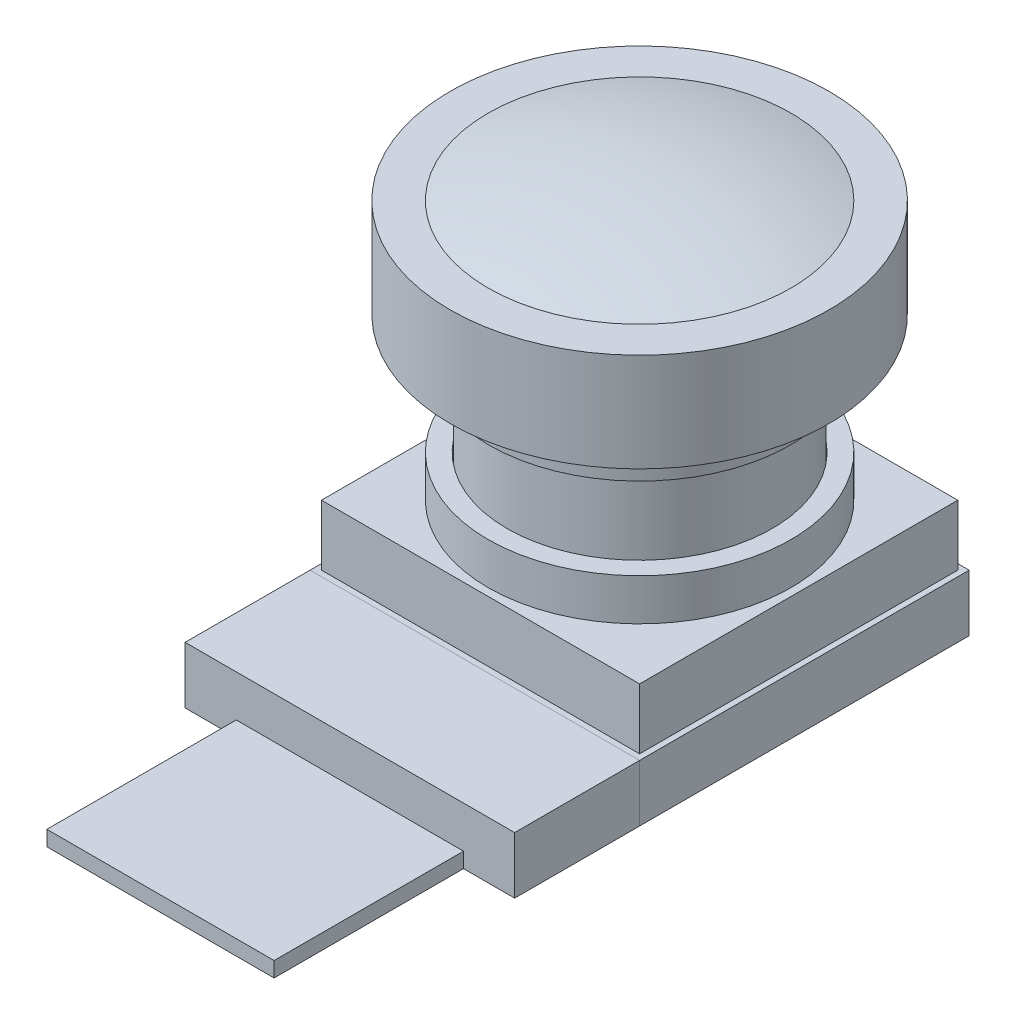
ISO-10303-21;
HEADER;
FILE_DESCRIPTION(('STEP AP214'),'2;1');
FILE_NAME('part.step','',(''),(''),'','','');
FILE_SCHEMA(('AUTOMOTIVE_DESIGN { 1 0 10303 214 1 1 1 1 }'));
ENDSEC;
DATA;
#1=APPLICATION_CONTEXT('core data for automotive mechanical design processes');
#2=APPLICATION_PROTOCOL_DEFINITION('international standard','automotive_design',2000,#1);
#3=PRODUCT_CONTEXT('',#1,'mechanical');
#4=PRODUCT('Part','Part','',(#3));
#5=PRODUCT_RELATED_PRODUCT_CATEGORY('part','',(#4));
#6=PRODUCT_DEFINITION_FORMATION('','',#4);
#7=PRODUCT_DEFINITION_CONTEXT('part definition',#1,'design');
#8=PRODUCT_DEFINITION('design','',#6,#7);
#9=PRODUCT_DEFINITION_SHAPE('','',#8);
#10=(LENGTH_UNIT() NAMED_UNIT(*) SI_UNIT(.MILLI.,.METRE.));
#11=(NAMED_UNIT(*) PLANE_ANGLE_UNIT() SI_UNIT($,.RADIAN.));
#12=(NAMED_UNIT(*) SI_UNIT($,.STERADIAN.) SOLID_ANGLE_UNIT());
#13=UNCERTAINTY_MEASURE_WITH_UNIT(LENGTH_MEASURE(1.E-05),#10,'distance_accuracy_value','');
#14=(GEOMETRIC_REPRESENTATION_CONTEXT(3) GLOBAL_UNCERTAINTY_ASSIGNED_CONTEXT((#13)) GLOBAL_UNIT_ASSIGNED_CONTEXT((#10,
#11,#12)) REPRESENTATION_CONTEXT('',''));
#15=CARTESIAN_POINT('',(0.,0.,0.));
#16=DIRECTION('',(0.,0.,1.));
#17=DIRECTION('',(1.,0.,0.));
#18=AXIS2_PLACEMENT_3D('',#15,#16,#17);
#19=CARTESIAN_POINT('',(-3.,0.4,7.65));
#20=DIRECTION('',(1.,0.,0.));
#21=DIRECTION('',(0.,0.,-1.));
#22=AXIS2_PLACEMENT_3D('',#19,#20,#21);
#23=PLANE('',#22);
#24=DIRECTION('',(0.,0.,1.));
#25=VECTOR('',#24,1.);
#26=CARTESIAN_POINT('',(-3.,0.,7.65));
#27=LINE('',#26,#25);
#28=CARTESIAN_POINT('',(-3.,0.,7.65));
#29=VERTEX_POINT('',#28);
#30=CARTESIAN_POINT('',(-3.,0.,12.65));
#31=VERTEX_POINT('',#30);
#32=EDGE_CURVE('E117',#29,#31,#27,.T.);
#33=ORIENTED_EDGE('',*,*,#32,.T.);
#34=DIRECTION('',(0.,-1.,0.));
#35=VECTOR('',#34,1.);
#36=CARTESIAN_POINT('',(-3.,0.4,12.65));
#37=LINE('',#36,#35);
#38=CARTESIAN_POINT('',(-3.,0.4,12.65));
#39=VERTEX_POINT('',#38);
#40=EDGE_CURVE('E12',#39,#31,#37,.T.);
#41=ORIENTED_EDGE('',*,*,#40,.F.);
#42=DIRECTION('',(0.,0.,1.));
#43=VECTOR('',#42,1.);
#44=CARTESIAN_POINT('',(-3.,0.4,7.65));
#45=LINE('',#44,#43);
#46=CARTESIAN_POINT('',(-3.,0.4,7.65));
#47=VERTEX_POINT('',#46);
#48=EDGE_CURVE('E105',#47,#39,#45,.T.);
#49=ORIENTED_EDGE('',*,*,#48,.F.);
#50=DIRECTION('',(0.,-1.,0.));
#51=VECTOR('',#50,1.);
#52=CARTESIAN_POINT('',(-3.,0.4,7.65));
#53=LINE('',#52,#51);
#54=EDGE_CURVE('E113',#47,#29,#53,.T.);
#55=ORIENTED_EDGE('',*,*,#54,.T.);
#56=EDGE_LOOP('',(#33,#41,#49,#55));
#57=FACE_BOUND('',#56,.T.);
#58=ADVANCED_FACE('F54',(#57),#23,.F.);
#59=CARTESIAN_POINT('',(-3.,0.4,12.65));
#60=DIRECTION('',(0.,0.,-1.));
#61=DIRECTION('',(-1.,0.,0.));
#62=AXIS2_PLACEMENT_3D('',#59,#60,#61);
#63=PLANE('',#62);
#64=DIRECTION('',(1.,0.,0.));
#65=VECTOR('',#64,1.);
#66=CARTESIAN_POINT('',(-3.,0.,12.65));
#67=LINE('',#66,#65);
#68=CARTESIAN_POINT('',(3.,0.,12.65));
#69=VERTEX_POINT('',#68);
#70=EDGE_CURVE('E109',#31,#69,#67,.T.);
#71=ORIENTED_EDGE('',*,*,#70,.T.);
#72=DIRECTION('',(0.,-1.,0.));
#73=VECTOR('',#72,1.);
#74=CARTESIAN_POINT('',(3.,0.4,12.65));
#75=LINE('',#74,#73);
#76=CARTESIAN_POINT('',(3.,0.4,12.65));
#77=VERTEX_POINT('',#76);
#78=EDGE_CURVE('E62',#77,#69,#75,.T.);
#79=ORIENTED_EDGE('',*,*,#78,.F.);
#80=DIRECTION('',(1.,0.,0.));
#81=VECTOR('',#80,1.);
#82=CARTESIAN_POINT('',(-3.,0.4,12.65));
#83=LINE('',#82,#81);
#84=EDGE_CURVE('E100',#39,#77,#83,.T.);
#85=ORIENTED_EDGE('',*,*,#84,.F.);
#86=ORIENTED_EDGE('',*,*,#40,.T.);
#87=EDGE_LOOP('',(#71,#79,#85,#86));
#88=FACE_BOUND('',#87,.T.);
#89=ADVANCED_FACE('F108',(#88),#63,.F.);
#90=CARTESIAN_POINT('',(3.,0.4,7.65));
#91=DIRECTION('',(-1.,0.,0.));
#92=DIRECTION('',(0.,0.,1.));
#93=AXIS2_PLACEMENT_3D('',#90,#91,#92);
#94=PLANE('',#93);
#95=DIRECTION('',(0.,0.,-1.));
#96=VECTOR('',#95,1.);
#97=CARTESIAN_POINT('',(3.,0.,7.65));
#98=LINE('',#97,#96);
#99=CARTESIAN_POINT('',(3.,0.,7.65));
#100=VERTEX_POINT('',#99);
#101=EDGE_CURVE('E87',#69,#100,#98,.T.);
#102=ORIENTED_EDGE('',*,*,#101,.T.);
#103=DIRECTION('',(0.,-1.,0.));
#104=VECTOR('',#103,1.);
#105=CARTESIAN_POINT('',(3.,0.4,7.65));
#106=LINE('',#105,#104);
#107=CARTESIAN_POINT('',(3.,0.4,7.65));
#108=VERTEX_POINT('',#107);
#109=EDGE_CURVE('E110',#108,#100,#106,.T.);
#110=ORIENTED_EDGE('',*,*,#109,.F.);
#111=DIRECTION('',(0.,0.,-1.));
#112=VECTOR('',#111,1.);
#113=CARTESIAN_POINT('',(3.,0.4,7.65));
#114=LINE('',#113,#112);
#115=EDGE_CURVE('E103',#77,#108,#114,.T.);
#116=ORIENTED_EDGE('',*,*,#115,.F.);
#117=ORIENTED_EDGE('',*,*,#78,.T.);
#118=EDGE_LOOP('',(#102,#110,#116,#117));
#119=FACE_BOUND('',#118,.T.);
#120=ADVANCED_FACE('F111',(#119),#94,.F.);
#121=CARTESIAN_POINT('',(-3.,0.4,7.65));
#122=DIRECTION('',(0.,0.,1.));
#123=DIRECTION('',(1.,0.,0.));
#124=AXIS2_PLACEMENT_3D('',#121,#122,#123);
#125=PLANE('',#124);
#126=DIRECTION('',(-1.,0.,0.));
#127=VECTOR('',#126,1.);
#128=CARTESIAN_POINT('',(-3.,0.,7.65));
#129=LINE('',#128,#127);
#130=EDGE_CURVE('E93',#100,#29,#129,.T.);
#131=ORIENTED_EDGE('',*,*,#130,.T.);
#132=ORIENTED_EDGE('',*,*,#54,.F.);
#133=DIRECTION('',(-1.,0.,0.));
#134=VECTOR('',#133,1.);
#135=CARTESIAN_POINT('',(-3.,0.4,7.65));
#136=LINE('',#135,#134);
#137=EDGE_CURVE('E70',#108,#47,#136,.T.);
#138=ORIENTED_EDGE('',*,*,#137,.F.);
#139=ORIENTED_EDGE('',*,*,#109,.T.);
#140=EDGE_LOOP('',(#131,#132,#138,#139));
#141=FACE_BOUND('',#140,.T.);
#142=ADVANCED_FACE('F124',(#141),#125,.F.);
#143=CARTESIAN_POINT('',(0.,0.4,0.));
#144=DIRECTION('',(0.,1.,0.));
#145=DIRECTION('',(0.,0.,1.));
#146=AXIS2_PLACEMENT_3D('',#143,#144,#145);
#147=PLANE('',#146);
#148=ORIENTED_EDGE('',*,*,#48,.T.);
#149=ORIENTED_EDGE('',*,*,#84,.T.);
#150=ORIENTED_EDGE('',*,*,#115,.T.);
#151=ORIENTED_EDGE('',*,*,#137,.T.);
#152=EDGE_LOOP('',(#148,#149,#150,#151));
#153=FACE_BOUND('',#152,.T.);
#154=ADVANCED_FACE('F101',(#153),#147,.T.);
#155=CARTESIAN_POINT('',(0.,0.,0.));
#156=DIRECTION('',(0.,1.,0.));
#157=DIRECTION('',(0.,0.,1.));
#158=AXIS2_PLACEMENT_3D('',#155,#156,#157);
#159=PLANE('',#158);
#160=ORIENTED_EDGE('',*,*,#32,.F.);
#161=ORIENTED_EDGE('',*,*,#130,.F.);
#162=ORIENTED_EDGE('',*,*,#101,.F.);
#163=ORIENTED_EDGE('',*,*,#70,.F.);
#164=EDGE_LOOP('',(#160,#161,#162,#163));
#165=FACE_BOUND('',#164,.T.);
#166=ADVANCED_FACE('F127',(#165),#159,.F.);
#167=CLOSED_SHELL('',(#58,#89,#120,#142,#154,#166));
#168=MANIFOLD_SOLID_BREP('B2',#167);
#169=CARTESIAN_POINT('',(-4.35,0.,7.65));
#170=DIRECTION('',(1.,0.,0.));
#171=DIRECTION('',(0.,0.,-1.));
#172=AXIS2_PLACEMENT_3D('',#169,#170,#171);
#173=PLANE('',#172);
#174=DIRECTION('',(0.,-1.,0.));
#175=VECTOR('',#174,1.);
#176=CARTESIAN_POINT('',(-4.35,0.,4.35));
#177=LINE('',#176,#175);
#178=CARTESIAN_POINT('',(-4.35,1.5,4.35));
#179=VERTEX_POINT('',#178);
#180=CARTESIAN_POINT('',(-4.35,0.,4.35));
#181=VERTEX_POINT('',#180);
#182=EDGE_CURVE('E263',#179,#181,#177,.T.);
#183=ORIENTED_EDGE('',*,*,#182,.T.);
#184=DIRECTION('',(0.,0.,-1.));
#185=VECTOR('',#184,1.);
#186=CARTESIAN_POINT('',(-4.35,0.,7.65));
#187=LINE('',#186,#185);
#188=CARTESIAN_POINT('',(-4.35,0.,7.65));
#189=VERTEX_POINT('',#188);
#190=EDGE_CURVE('E52',#189,#181,#187,.T.);
#191=ORIENTED_EDGE('',*,*,#190,.F.);
#192=DIRECTION('',(0.,-1.,0.));
#193=VECTOR('',#192,1.);
#194=CARTESIAN_POINT('',(-4.35,0.,7.65));
#195=LINE('',#194,#193);
#196=CARTESIAN_POINT('',(-4.35,1.5,7.65));
#197=VERTEX_POINT('',#196);
#198=EDGE_CURVE('E251',#197,#189,#195,.T.);
#199=ORIENTED_EDGE('',*,*,#198,.F.);
#200=DIRECTION('',(0.,0.,-1.));
#201=VECTOR('',#200,1.);
#202=CARTESIAN_POINT('',(-4.35,1.5,7.65));
#203=LINE('',#202,#201);
#204=EDGE_CURVE('E259',#197,#179,#203,.T.);
#205=ORIENTED_EDGE('',*,*,#204,.T.);
#206=EDGE_LOOP('',(#183,#191,#199,#205));
#207=FACE_BOUND('',#206,.T.);
#208=ADVANCED_FACE('F200',(#207),#173,.F.);
#209=CARTESIAN_POINT('',(-4.35,0.,7.65));
#210=DIRECTION('',(0.,1.,0.));
#211=DIRECTION('',(0.,0.,1.));
#212=AXIS2_PLACEMENT_3D('',#209,#210,#211);
#213=PLANE('',#212);
#214=DIRECTION('',(1.,0.,0.));
#215=VECTOR('',#214,1.);
#216=CARTESIAN_POINT('',(-4.35,0.,4.35));
#217=LINE('',#216,#215);
#218=CARTESIAN_POINT('',(4.35,0.,4.35));
#219=VERTEX_POINT('',#218);
#220=EDGE_CURVE('E255',#181,#219,#217,.T.);
#221=ORIENTED_EDGE('',*,*,#220,.T.);
#222=DIRECTION('',(0.,0.,-1.));
#223=VECTOR('',#222,1.);
#224=CARTESIAN_POINT('',(4.35,0.,7.65));
#225=LINE('',#224,#223);
#226=CARTESIAN_POINT('',(4.35,0.,7.65));
#227=VERTEX_POINT('',#226);
#228=EDGE_CURVE('E208',#227,#219,#225,.T.);
#229=ORIENTED_EDGE('',*,*,#228,.F.);
#230=DIRECTION('',(1.,0.,0.));
#231=VECTOR('',#230,1.);
#232=CARTESIAN_POINT('',(-4.35,0.,7.65));
#233=LINE('',#232,#231);
#234=EDGE_CURVE('E246',#189,#227,#233,.T.);
#235=ORIENTED_EDGE('',*,*,#234,.F.);
#236=ORIENTED_EDGE('',*,*,#190,.T.);
#237=EDGE_LOOP('',(#221,#229,#235,#236));
#238=FACE_BOUND('',#237,.T.);
#239=ADVANCED_FACE('F254',(#238),#213,.F.);
#240=CARTESIAN_POINT('',(4.35,0.,7.65));
#241=DIRECTION('',(-1.,0.,0.));
#242=DIRECTION('',(0.,0.,1.));
#243=AXIS2_PLACEMENT_3D('',#240,#241,#242);
#244=PLANE('',#243);
#245=DIRECTION('',(0.,1.,0.));
#246=VECTOR('',#245,1.);
#247=CARTESIAN_POINT('',(4.35,0.,4.35));
#248=LINE('',#247,#246);
#249=CARTESIAN_POINT('',(4.35,1.5,4.35));
#250=VERTEX_POINT('',#249);
#251=EDGE_CURVE('E233',#219,#250,#248,.T.);
#252=ORIENTED_EDGE('',*,*,#251,.T.);
#253=DIRECTION('',(0.,0.,-1.));
#254=VECTOR('',#253,1.);
#255=CARTESIAN_POINT('',(4.35,1.5,7.65));
#256=LINE('',#255,#254);
#257=CARTESIAN_POINT('',(4.35,1.5,7.65));
#258=VERTEX_POINT('',#257);
#259=EDGE_CURVE('E256',#258,#250,#256,.T.);
#260=ORIENTED_EDGE('',*,*,#259,.F.);
#261=DIRECTION('',(0.,1.,0.));
#262=VECTOR('',#261,1.);
#263=CARTESIAN_POINT('',(4.35,0.,7.65));
#264=LINE('',#263,#262);
#265=EDGE_CURVE('E249',#227,#258,#264,.T.);
#266=ORIENTED_EDGE('',*,*,#265,.F.);
#267=ORIENTED_EDGE('',*,*,#228,.T.);
#268=EDGE_LOOP('',(#252,#260,#266,#267));
#269=FACE_BOUND('',#268,.T.);
#270=ADVANCED_FACE('F257',(#269),#244,.F.);
#271=CARTESIAN_POINT('',(-4.35,1.5,7.65));
#272=DIRECTION('',(0.,-1.,0.));
#273=DIRECTION('',(0.,0.,-1.));
#274=AXIS2_PLACEMENT_3D('',#271,#272,#273);
#275=PLANE('',#274);
#276=DIRECTION('',(-1.,0.,0.));
#277=VECTOR('',#276,1.);
#278=CARTESIAN_POINT('',(-4.35,1.5,4.35));
#279=LINE('',#278,#277);
#280=EDGE_CURVE('E239',#250,#179,#279,.T.);
#281=ORIENTED_EDGE('',*,*,#280,.T.);
#282=ORIENTED_EDGE('',*,*,#204,.F.);
#283=DIRECTION('',(-1.,0.,0.));
#284=VECTOR('',#283,1.);
#285=CARTESIAN_POINT('',(-4.35,1.5,7.65));
#286=LINE('',#285,#284);
#287=EDGE_CURVE('E216',#258,#197,#286,.T.);
#288=ORIENTED_EDGE('',*,*,#287,.F.);
#289=ORIENTED_EDGE('',*,*,#259,.T.);
#290=EDGE_LOOP('',(#281,#282,#288,#289));
#291=FACE_BOUND('',#290,.T.);
#292=ADVANCED_FACE('F270',(#291),#275,.F.);
#293=CARTESIAN_POINT('',(0.,0.,7.65));
#294=DIRECTION('',(0.,0.,-1.));
#295=DIRECTION('',(-1.,0.,0.));
#296=AXIS2_PLACEMENT_3D('',#293,#294,#295);
#297=PLANE('',#296);
#298=ORIENTED_EDGE('',*,*,#198,.T.);
#299=ORIENTED_EDGE('',*,*,#234,.T.);
#300=ORIENTED_EDGE('',*,*,#265,.T.);
#301=ORIENTED_EDGE('',*,*,#287,.T.);
#302=EDGE_LOOP('',(#298,#299,#300,#301));
#303=FACE_BOUND('',#302,.T.);
#304=ADVANCED_FACE('F247',(#303),#297,.F.);
#305=CARTESIAN_POINT('',(0.,0.,4.35));
#306=DIRECTION('',(0.,0.,-1.));
#307=DIRECTION('',(-1.,0.,0.));
#308=AXIS2_PLACEMENT_3D('',#305,#306,#307);
#309=PLANE('',#308);
#310=ORIENTED_EDGE('',*,*,#182,.F.);
#311=ORIENTED_EDGE('',*,*,#280,.F.);
#312=ORIENTED_EDGE('',*,*,#251,.F.);
#313=ORIENTED_EDGE('',*,*,#220,.F.);
#314=EDGE_LOOP('',(#310,#311,#312,#313));
#315=FACE_BOUND('',#314,.T.);
#316=ADVANCED_FACE('F273',(#315),#309,.T.);
#317=CLOSED_SHELL('',(#208,#239,#270,#292,#304,#316));
#318=MANIFOLD_SOLID_BREP('B6',#317);
#319=CARTESIAN_POINT('',(0.,3.1,0.));
#320=DIRECTION('',(0.,1.,0.));
#321=DIRECTION('',(0.,0.,1.));
#322=AXIS2_PLACEMENT_3D('',#319,#320,#321);
#323=PLANE('',#322);
#324=CARTESIAN_POINT('',(0.,3.1,0.));
#325=DIRECTION('',(0.,1.,0.));
#326=DIRECTION('',(0.,0.,1.));
#327=AXIS2_PLACEMENT_3D('',#324,#325,#326);
#328=CIRCLE('',#327,4.);
#329=CARTESIAN_POINT('',(0.,3.1,4.));
#330=VERTEX_POINT('',#329);
#331=EDGE_CURVE('E491',#330,#330,#328,.T.);
#332=ORIENTED_EDGE('',*,*,#331,.F.);
#333=EDGE_LOOP('',(#332));
#334=FACE_BOUND('',#333,.T.);
#335=DIRECTION('',(1.,0.,0.));
#336=VECTOR('',#335,1.);
#337=CARTESIAN_POINT('',(-4.2,3.1,4.2));
#338=LINE('',#337,#336);
#339=CARTESIAN_POINT('',(-4.2,3.1,4.2));
#340=VERTEX_POINT('',#339);
#341=CARTESIAN_POINT('',(4.2,3.1,4.2));
#342=VERTEX_POINT('',#341);
#343=EDGE_CURVE('E588',#340,#342,#338,.T.);
#344=ORIENTED_EDGE('',*,*,#343,.T.);
#345=DIRECTION('',(0.,0.,-1.));
#346=VECTOR('',#345,1.);
#347=CARTESIAN_POINT('',(4.2,3.1,-4.2));
#348=LINE('',#347,#346);
#349=CARTESIAN_POINT('',(4.2,3.1,-4.2));
#350=VERTEX_POINT('',#349);
#351=EDGE_CURVE('E586',#342,#350,#348,.T.);
#352=ORIENTED_EDGE('',*,*,#351,.T.);
#353=DIRECTION('',(-1.,0.,0.));
#354=VECTOR('',#353,1.);
#355=CARTESIAN_POINT('',(-4.2,3.1,-4.2));
#356=LINE('',#355,#354);
#357=CARTESIAN_POINT('',(-4.2,3.1,-4.2));
#358=VERTEX_POINT('',#357);
#359=EDGE_CURVE('E569',#350,#358,#356,.T.);
#360=ORIENTED_EDGE('',*,*,#359,.T.);
#361=DIRECTION('',(0.,0.,1.));
#362=VECTOR('',#361,1.);
#363=CARTESIAN_POINT('',(-4.2,3.1,-4.2));
#364=LINE('',#363,#362);
#365=EDGE_CURVE('E360',#358,#340,#364,.T.);
#366=ORIENTED_EDGE('',*,*,#365,.T.);
#367=EDGE_LOOP('',(#344,#352,#360,#366));
#368=FACE_BOUND('',#367,.T.);
#369=ADVANCED_FACE('F337',(#334,#368),#323,.T.);
#370=CARTESIAN_POINT('',(0.,29.7429263941167,0.));
#371=DIRECTION('',(0.,-1.,0.));
#372=DIRECTION('',(0.,0.,-1.));
#373=AXIS2_PLACEMENT_3D('',#370,#371,#372);
#374=CYLINDRICAL_SURFACE('',#373,3.48);
#375=CARTESIAN_POINT('',(0.,6.35,0.));
#376=DIRECTION('',(0.,-1.,0.));
#377=DIRECTION('',(0.,0.,-1.));
#378=AXIS2_PLACEMENT_3D('',#375,#376,#377);
#379=CIRCLE('',#378,3.48);
#380=CARTESIAN_POINT('',(0.,6.35,-3.48));
#381=VERTEX_POINT('',#380);
#382=EDGE_CURVE('E600',#381,#381,#379,.T.);
#383=ORIENTED_EDGE('',*,*,#382,.T.);
#384=EDGE_LOOP('',(#383));
#385=FACE_BOUND('',#384,.T.);
#386=CARTESIAN_POINT('',(0.,3.1,0.));
#387=DIRECTION('',(0.,1.,0.));
#388=DIRECTION('',(0.,0.,1.));
#389=AXIS2_PLACEMENT_3D('',#386,#387,#388);
#390=CIRCLE('',#389,3.48);
#391=CARTESIAN_POINT('',(0.,3.1,3.48));
#392=VERTEX_POINT('',#391);
#393=EDGE_CURVE('E483',#392,#392,#390,.T.);
#394=ORIENTED_EDGE('',*,*,#393,.T.);
#395=EDGE_LOOP('',(#394));
#396=FACE_BOUND('',#395,.T.);
#397=ADVANCED_FACE('F452',(#385,#396),#374,.T.);
#398=CARTESIAN_POINT('',(0.,4.2,0.));
#399=DIRECTION('',(0.,1.,0.));
#400=DIRECTION('',(0.,0.,1.));
#401=AXIS2_PLACEMENT_3D('',#398,#399,#400);
#402=PLANE('',#401);
#403=CARTESIAN_POINT('',(0.,4.2,0.));
#404=DIRECTION('',(0.,1.,0.));
#405=DIRECTION('',(0.,0.,1.));
#406=AXIS2_PLACEMENT_3D('',#403,#404,#405);
#407=CIRCLE('',#406,4.);
#408=CARTESIAN_POINT('',(0.,4.2,4.));
#409=VERTEX_POINT('',#408);
#410=EDGE_CURVE('E498',#409,#409,#407,.T.);
#411=ORIENTED_EDGE('',*,*,#410,.T.);
#412=EDGE_LOOP('',(#411));
#413=FACE_BOUND('',#412,.T.);
#414=CARTESIAN_POINT('',(0.,4.2,0.));
#415=DIRECTION('',(0.,1.,0.));
#416=DIRECTION('',(0.,0.,1.));
#417=AXIS2_PLACEMENT_3D('',#414,#415,#416);
#418=CIRCLE('',#417,3.5);
#419=CARTESIAN_POINT('',(0.,4.2,3.5));
#420=VERTEX_POINT('',#419);
#421=EDGE_CURVE('E487',#420,#420,#418,.T.);
#422=ORIENTED_EDGE('',*,*,#421,.F.);
#423=EDGE_LOOP('',(#422));
#424=FACE_BOUND('',#423,.T.);
#425=ADVANCED_FACE('F459',(#413,#424),#402,.T.);
#426=CARTESIAN_POINT('',(0.,4.2,0.));
#427=DIRECTION('',(0.,-1.,0.));
#428=DIRECTION('',(0.,0.,-1.));
#429=AXIS2_PLACEMENT_3D('',#426,#427,#428);
#430=CYLINDRICAL_SURFACE('',#429,4.);
#431=ORIENTED_EDGE('',*,*,#410,.F.);
#432=EDGE_LOOP('',(#431));
#433=FACE_BOUND('',#432,.T.);
#434=ORIENTED_EDGE('',*,*,#331,.T.);
#435=EDGE_LOOP('',(#434));
#436=FACE_BOUND('',#435,.T.);
#437=ADVANCED_FACE('F477',(#433,#436),#430,.T.);
#438=CARTESIAN_POINT('',(0.,4.2,0.));
#439=DIRECTION('',(0.,-1.,0.));
#440=DIRECTION('',(0.,0.,-1.));
#441=AXIS2_PLACEMENT_3D('',#438,#439,#440);
#442=CYLINDRICAL_SURFACE('',#441,3.5);
#443=ORIENTED_EDGE('',*,*,#421,.T.);
#444=EDGE_LOOP('',(#443));
#445=FACE_BOUND('',#444,.T.);
#446=CARTESIAN_POINT('',(0.,3.1,0.));
#447=DIRECTION('',(0.,1.,0.));
#448=DIRECTION('',(0.,0.,1.));
#449=AXIS2_PLACEMENT_3D('',#446,#447,#448);
#450=CIRCLE('',#449,3.5);
#451=CARTESIAN_POINT('',(0.,3.1,3.5));
#452=VERTEX_POINT('',#451);
#453=EDGE_CURVE('E422',#452,#452,#450,.F.);
#454=ORIENTED_EDGE('',*,*,#453,.T.);
#455=EDGE_LOOP('',(#454));
#456=FACE_BOUND('',#455,.T.);
#457=ADVANCED_FACE('F468',(#445,#456),#442,.F.);
#458=ORIENTED_EDGE('',*,*,#393,.F.);
#459=EDGE_LOOP('',(#458));
#460=FACE_BOUND('',#459,.T.);
#461=ORIENTED_EDGE('',*,*,#453,.F.);
#462=EDGE_LOOP('',(#461));
#463=FACE_BOUND('',#462,.T.);
#464=ADVANCED_FACE('F455',(#460,#463),#323,.T.);
#465=CARTESIAN_POINT('',(4.2,-10.8036579926459,-4.2));
#466=DIRECTION('',(1.,0.,0.));
#467=DIRECTION('',(0.,0.,-1.));
#468=AXIS2_PLACEMENT_3D('',#465,#466,#467);
#469=PLANE('',#468);
#470=DIRECTION('',(0.,0.,-1.));
#471=VECTOR('',#470,1.);
#472=CARTESIAN_POINT('',(4.2,1.5,-4.2));
#473=LINE('',#472,#471);
#474=CARTESIAN_POINT('',(4.2,1.5,4.2));
#475=VERTEX_POINT('',#474);
#476=CARTESIAN_POINT('',(4.2,1.5,-4.2));
#477=VERTEX_POINT('',#476);
#478=EDGE_CURVE('E568',#475,#477,#473,.T.);
#479=ORIENTED_EDGE('',*,*,#478,.T.);
#480=DIRECTION('',(0.,1.,0.));
#481=VECTOR('',#480,1.);
#482=CARTESIAN_POINT('',(4.2,-10.8036579926459,-4.2));
#483=LINE('',#482,#481);
#484=EDGE_CURVE('E575',#477,#350,#483,.T.);
#485=ORIENTED_EDGE('',*,*,#484,.T.);
#486=ORIENTED_EDGE('',*,*,#351,.F.);
#487=DIRECTION('',(0.,1.,0.));
#488=VECTOR('',#487,1.);
#489=CARTESIAN_POINT('',(4.2,-10.8036579926459,4.2));
#490=LINE('',#489,#488);
#491=EDGE_CURVE('E409',#475,#342,#490,.T.);
#492=ORIENTED_EDGE('',*,*,#491,.F.);
#493=EDGE_LOOP('',(#479,#485,#486,#492));
#494=FACE_BOUND('',#493,.T.);
#495=ADVANCED_FACE('F467',(#494),#469,.T.);
#496=CARTESIAN_POINT('',(-4.2,-10.8036579926459,4.2));
#497=DIRECTION('',(0.,0.,1.));
#498=DIRECTION('',(1.,0.,0.));
#499=AXIS2_PLACEMENT_3D('',#496,#497,#498);
#500=PLANE('',#499);
#501=DIRECTION('',(1.,0.,0.));
#502=VECTOR('',#501,1.);
#503=CARTESIAN_POINT('',(-4.2,1.5,4.2));
#504=LINE('',#503,#502);
#505=CARTESIAN_POINT('',(-4.2,1.5,4.2));
#506=VERTEX_POINT('',#505);
#507=EDGE_CURVE('E561',#506,#475,#504,.T.);
#508=ORIENTED_EDGE('',*,*,#507,.T.);
#509=ORIENTED_EDGE('',*,*,#491,.T.);
#510=ORIENTED_EDGE('',*,*,#343,.F.);
#511=DIRECTION('',(0.,1.,0.));
#512=VECTOR('',#511,1.);
#513=CARTESIAN_POINT('',(-4.2,-10.8036579926459,4.2));
#514=LINE('',#513,#512);
#515=EDGE_CURVE('E565',#506,#340,#514,.T.);
#516=ORIENTED_EDGE('',*,*,#515,.F.);
#517=EDGE_LOOP('',(#508,#509,#510,#516));
#518=FACE_BOUND('',#517,.T.);
#519=ADVANCED_FACE('F474',(#518),#500,.T.);
#520=CARTESIAN_POINT('',(-4.2,-10.8036579926459,-4.2));
#521=DIRECTION('',(-1.,0.,0.));
#522=DIRECTION('',(0.,0.,1.));
#523=AXIS2_PLACEMENT_3D('',#520,#521,#522);
#524=PLANE('',#523);
#525=DIRECTION('',(0.,0.,1.));
#526=VECTOR('',#525,1.);
#527=CARTESIAN_POINT('',(-4.2,1.5,-4.2));
#528=LINE('',#527,#526);
#529=CARTESIAN_POINT('',(-4.2,1.5,-4.2));
#530=VERTEX_POINT('',#529);
#531=EDGE_CURVE('E578',#530,#506,#528,.T.);
#532=ORIENTED_EDGE('',*,*,#531,.T.);
#533=ORIENTED_EDGE('',*,*,#515,.T.);
#534=ORIENTED_EDGE('',*,*,#365,.F.);
#535=DIRECTION('',(0.,1.,0.));
#536=VECTOR('',#535,1.);
#537=CARTESIAN_POINT('',(-4.2,-10.8036579926459,-4.2));
#538=LINE('',#537,#536);
#539=EDGE_CURVE('E589',#530,#358,#538,.T.);
#540=ORIENTED_EDGE('',*,*,#539,.F.);
#541=EDGE_LOOP('',(#532,#533,#534,#540));
#542=FACE_BOUND('',#541,.T.);
#543=ADVANCED_FACE('F551',(#542),#524,.T.);
#544=CARTESIAN_POINT('',(-4.2,-10.8036579926459,-4.2));
#545=DIRECTION('',(0.,0.,-1.));
#546=DIRECTION('',(-1.,0.,0.));
#547=AXIS2_PLACEMENT_3D('',#544,#545,#546);
#548=PLANE('',#547);
#549=DIRECTION('',(-1.,0.,0.));
#550=VECTOR('',#549,1.);
#551=CARTESIAN_POINT('',(-4.2,1.5,-4.2));
#552=LINE('',#551,#550);
#553=EDGE_CURVE('E572',#477,#530,#552,.T.);
#554=ORIENTED_EDGE('',*,*,#553,.T.);
#555=ORIENTED_EDGE('',*,*,#539,.T.);
#556=ORIENTED_EDGE('',*,*,#359,.F.);
#557=ORIENTED_EDGE('',*,*,#484,.F.);
#558=EDGE_LOOP('',(#554,#555,#556,#557));
#559=FACE_BOUND('',#558,.T.);
#560=ADVANCED_FACE('F528',(#559),#548,.T.);
#561=CARTESIAN_POINT('',(-4.35,1.5,7.65));
#562=DIRECTION('',(0.,-1.,0.));
#563=DIRECTION('',(0.,0.,-1.));
#564=AXIS2_PLACEMENT_3D('',#561,#562,#563);
#565=PLANE('',#564);
#566=DIRECTION('',(1.,0.,0.));
#567=VECTOR('',#566,1.);
#568=CARTESIAN_POINT('',(-4.35,1.5,4.35));
#569=LINE('',#568,#567);
#570=CARTESIAN_POINT('',(-4.35,1.5,4.35));
#571=VERTEX_POINT('',#570);
#572=CARTESIAN_POINT('',(4.35,1.5,4.35));
#573=VERTEX_POINT('',#572);
#574=EDGE_CURVE('E405',#571,#573,#569,.T.);
#575=ORIENTED_EDGE('',*,*,#574,.T.);
#576=DIRECTION('',(0.,0.,-1.));
#577=VECTOR('',#576,1.);
#578=CARTESIAN_POINT('',(4.35,1.5,4.35));
#579=LINE('',#578,#577);
#580=CARTESIAN_POINT('',(4.35,1.5,-4.35));
#581=VERTEX_POINT('',#580);
#582=EDGE_CURVE('E400',#573,#581,#579,.T.);
#583=ORIENTED_EDGE('',*,*,#582,.T.);
#584=DIRECTION('',(-1.,0.,0.));
#585=VECTOR('',#584,1.);
#586=CARTESIAN_POINT('',(4.35,1.5,-4.35));
#587=LINE('',#586,#585);
#588=CARTESIAN_POINT('',(-4.35,1.5,-4.35));
#589=VERTEX_POINT('',#588);
#590=EDGE_CURVE('E404',#581,#589,#587,.T.);
#591=ORIENTED_EDGE('',*,*,#590,.T.);
#592=DIRECTION('',(0.,0.,1.));
#593=VECTOR('',#592,1.);
#594=CARTESIAN_POINT('',(-4.35,1.5,-4.35));
#595=LINE('',#594,#593);
#596=EDGE_CURVE('E352',#589,#571,#595,.T.);
#597=ORIENTED_EDGE('',*,*,#596,.T.);
#598=EDGE_LOOP('',(#575,#583,#591,#597));
#599=FACE_BOUND('',#598,.T.);
#600=ORIENTED_EDGE('',*,*,#507,.F.);
#601=ORIENTED_EDGE('',*,*,#531,.F.);
#602=ORIENTED_EDGE('',*,*,#553,.F.);
#603=ORIENTED_EDGE('',*,*,#478,.F.);
#604=EDGE_LOOP('',(#600,#601,#602,#603));
#605=FACE_BOUND('',#604,.T.);
#606=ADVANCED_FACE('F402',(#599,#605),#565,.F.);
#607=CARTESIAN_POINT('',(0.,0.,0.));
#608=DIRECTION('',(0.,1.,0.));
#609=DIRECTION('',(0.,0.,1.));
#610=AXIS2_PLACEMENT_3D('',#607,#608,#609);
#611=PLANE('',#610);
#612=DIRECTION('',(0.,0.,-1.));
#613=VECTOR('',#612,1.);
#614=CARTESIAN_POINT('',(4.35,0.,-4.35));
#615=LINE('',#614,#613);
#616=CARTESIAN_POINT('',(4.35,0.,4.35));
#617=VERTEX_POINT('',#616);
#618=CARTESIAN_POINT('',(4.35,0.,-4.35));
#619=VERTEX_POINT('',#618);
#620=EDGE_CURVE('E421',#617,#619,#615,.T.);
#621=ORIENTED_EDGE('',*,*,#620,.F.);
#622=DIRECTION('',(1.,0.,0.));
#623=VECTOR('',#622,1.);
#624=CARTESIAN_POINT('',(-4.35,0.,4.35));
#625=LINE('',#624,#623);
#626=CARTESIAN_POINT('',(-4.35,0.,4.35));
#627=VERTEX_POINT('',#626);
#628=EDGE_CURVE('E509',#627,#617,#625,.T.);
#629=ORIENTED_EDGE('',*,*,#628,.F.);
#630=DIRECTION('',(0.,0.,1.));
#631=VECTOR('',#630,1.);
#632=CARTESIAN_POINT('',(-4.35,0.,-4.35));
#633=LINE('',#632,#631);
#634=CARTESIAN_POINT('',(-4.35,0.,-4.35));
#635=VERTEX_POINT('',#634);
#636=EDGE_CURVE('E506',#635,#627,#633,.T.);
#637=ORIENTED_EDGE('',*,*,#636,.F.);
#638=DIRECTION('',(-1.,0.,0.));
#639=VECTOR('',#638,1.);
#640=CARTESIAN_POINT('',(-4.35,0.,-4.35));
#641=LINE('',#640,#639);
#642=EDGE_CURVE('E504',#619,#635,#641,.T.);
#643=ORIENTED_EDGE('',*,*,#642,.F.);
#644=EDGE_LOOP('',(#621,#629,#637,#643));
#645=FACE_BOUND('',#644,.T.);
#646=ADVANCED_FACE('F521',(#645),#611,.F.);
#647=CARTESIAN_POINT('',(-4.35,3.1,4.35));
#648=DIRECTION('',(0.,0.,-1.));
#649=DIRECTION('',(-1.,0.,0.));
#650=AXIS2_PLACEMENT_3D('',#647,#648,#649);
#651=PLANE('',#650);
#652=DIRECTION('',(0.,-1.,0.));
#653=VECTOR('',#652,1.);
#654=CARTESIAN_POINT('',(4.35,3.1,4.35));
#655=LINE('',#654,#653);
#656=EDGE_CURVE('E512',#573,#617,#655,.T.);
#657=ORIENTED_EDGE('',*,*,#656,.F.);
#658=ORIENTED_EDGE('',*,*,#574,.F.);
#659=DIRECTION('',(0.,-1.,0.));
#660=VECTOR('',#659,1.);
#661=CARTESIAN_POINT('',(-4.35,3.1,4.35));
#662=LINE('',#661,#660);
#663=EDGE_CURVE('E426',#571,#627,#662,.T.);
#664=ORIENTED_EDGE('',*,*,#663,.T.);
#665=ORIENTED_EDGE('',*,*,#628,.T.);
#666=EDGE_LOOP('',(#657,#658,#664,#665));
#667=FACE_BOUND('',#666,.T.);
#668=ADVANCED_FACE('F515',(#667),#651,.F.);
#669=CARTESIAN_POINT('',(-4.35,3.1,-4.35));
#670=DIRECTION('',(1.,0.,0.));
#671=DIRECTION('',(0.,0.,-1.));
#672=AXIS2_PLACEMENT_3D('',#669,#670,#671);
#673=PLANE('',#672);
#674=ORIENTED_EDGE('',*,*,#663,.F.);
#675=ORIENTED_EDGE('',*,*,#596,.F.);
#676=DIRECTION('',(0.,-1.,0.));
#677=VECTOR('',#676,1.);
#678=CARTESIAN_POINT('',(-4.35,3.1,-4.35));
#679=LINE('',#678,#677);
#680=EDGE_CURVE('E417',#589,#635,#679,.T.);
#681=ORIENTED_EDGE('',*,*,#680,.T.);
#682=ORIENTED_EDGE('',*,*,#636,.T.);
#683=EDGE_LOOP('',(#674,#675,#681,#682));
#684=FACE_BOUND('',#683,.T.);
#685=ADVANCED_FACE('F519',(#684),#673,.F.);
#686=CARTESIAN_POINT('',(-4.35,3.1,-4.35));
#687=DIRECTION('',(0.,0.,1.));
#688=DIRECTION('',(1.,0.,0.));
#689=AXIS2_PLACEMENT_3D('',#686,#687,#688);
#690=PLANE('',#689);
#691=ORIENTED_EDGE('',*,*,#680,.F.);
#692=ORIENTED_EDGE('',*,*,#590,.F.);
#693=DIRECTION('',(0.,-1.,0.));
#694=VECTOR('',#693,1.);
#695=CARTESIAN_POINT('',(4.35,3.1,-4.35));
#696=LINE('',#695,#694);
#697=EDGE_CURVE('E415',#581,#619,#696,.T.);
#698=ORIENTED_EDGE('',*,*,#697,.T.);
#699=ORIENTED_EDGE('',*,*,#642,.T.);
#700=EDGE_LOOP('',(#691,#692,#698,#699));
#701=FACE_BOUND('',#700,.T.);
#702=ADVANCED_FACE('F413',(#701),#690,.F.);
#703=CARTESIAN_POINT('',(4.35,3.1,-4.35));
#704=DIRECTION('',(-1.,0.,0.));
#705=DIRECTION('',(0.,0.,1.));
#706=AXIS2_PLACEMENT_3D('',#703,#704,#705);
#707=PLANE('',#706);
#708=ORIENTED_EDGE('',*,*,#697,.F.);
#709=ORIENTED_EDGE('',*,*,#582,.F.);
#710=ORIENTED_EDGE('',*,*,#656,.T.);
#711=ORIENTED_EDGE('',*,*,#620,.T.);
#712=EDGE_LOOP('',(#708,#709,#710,#711));
#713=FACE_BOUND('',#712,.T.);
#714=ADVANCED_FACE('F339',(#713),#707,.F.);
#715=CARTESIAN_POINT('',(0.,6.35,0.));
#716=DIRECTION('',(0.,-1.,0.));
#717=DIRECTION('',(0.,0.,-1.));
#718=AXIS2_PLACEMENT_3D('',#715,#716,#717);
#719=PLANE('',#718);
#720=CARTESIAN_POINT('',(0.,6.35,0.));
#721=DIRECTION('',(0.,-1.,0.));
#722=DIRECTION('',(0.,0.,-1.));
#723=AXIS2_PLACEMENT_3D('',#720,#721,#722);
#724=CIRCLE('',#723,3.98);
#725=CARTESIAN_POINT('',(0.,6.35,-3.98));
#726=VERTEX_POINT('',#725);
#727=EDGE_CURVE('E581',#726,#726,#724,.T.);
#728=ORIENTED_EDGE('',*,*,#727,.T.);
#729=EDGE_LOOP('',(#728));
#730=FACE_BOUND('',#729,.T.);
#731=ORIENTED_EDGE('',*,*,#382,.F.);
#732=EDGE_LOOP('',(#731));
#733=FACE_BOUND('',#732,.T.);
#734=ADVANCED_FACE('F535',(#730,#733),#719,.T.);
#735=CARTESIAN_POINT('',(0.,6.35,0.));
#736=DIRECTION('',(0.,1.,0.));
#737=DIRECTION('',(0.,0.,1.));
#738=AXIS2_PLACEMENT_3D('',#735,#736,#737);
#739=CYLINDRICAL_SURFACE('',#738,3.98);
#740=ORIENTED_EDGE('',*,*,#727,.F.);
#741=EDGE_LOOP('',(#740));
#742=FACE_BOUND('',#741,.T.);
#743=CARTESIAN_POINT('',(0.,7.35,0.));
#744=DIRECTION('',(0.,1.,0.));
#745=DIRECTION('',(0.,0.,1.));
#746=AXIS2_PLACEMENT_3D('',#743,#744,#745);
#747=CIRCLE('',#746,3.98);
#748=CARTESIAN_POINT('',(0.,7.35,3.98));
#749=VERTEX_POINT('',#748);
#750=EDGE_CURVE('E345',#749,#749,#747,.F.);
#751=ORIENTED_EDGE('',*,*,#750,.T.);
#752=EDGE_LOOP('',(#751));
#753=FACE_BOUND('',#752,.T.);
#754=ADVANCED_FACE('F432',(#742,#753),#739,.T.);
#755=CARTESIAN_POINT('',(0.,9.95,0.));
#756=DIRECTION('',(0.,1.,0.));
#757=DIRECTION('',(0.,0.,1.));
#758=AXIS2_PLACEMENT_3D('',#755,#756,#757);
#759=PLANE('',#758);
#760=CARTESIAN_POINT('',(0.,9.95,0.));
#761=DIRECTION('',(0.,1.,0.));
#762=DIRECTION('',(0.,0.,1.));
#763=AXIS2_PLACEMENT_3D('',#760,#761,#762);
#764=CIRCLE('',#763,4.);
#765=CARTESIAN_POINT('',(0.,9.95,4.));
#766=VERTEX_POINT('',#765);
#767=EDGE_CURVE('E198',#766,#766,#764,.T.);
#768=ORIENTED_EDGE('',*,*,#767,.F.);
#769=EDGE_LOOP('',(#768));
#770=FACE_BOUND('',#769,.T.);
#771=CARTESIAN_POINT('',(0.,9.95,0.));
#772=DIRECTION('',(0.,1.,0.));
#773=DIRECTION('',(0.,0.,1.));
#774=AXIS2_PLACEMENT_3D('',#771,#772,#773);
#775=CIRCLE('',#774,5.);
#776=CARTESIAN_POINT('',(0.,9.95,5.));
#777=VERTEX_POINT('',#776);
#778=EDGE_CURVE('E494',#777,#777,#775,.T.);
#779=ORIENTED_EDGE('',*,*,#778,.T.);
#780=EDGE_LOOP('',(#779));
#781=FACE_BOUND('',#780,.T.);
#782=ADVANCED_FACE('F446',(#770,#781),#759,.T.);
#783=CARTESIAN_POINT('',(0.,7.35,0.));
#784=DIRECTION('',(0.,1.,0.));
#785=DIRECTION('',(0.,0.,1.));
#786=AXIS2_PLACEMENT_3D('',#783,#784,#785);
#787=CYLINDRICAL_SURFACE('',#786,5.);
#788=CARTESIAN_POINT('',(0.,7.35,0.));
#789=DIRECTION('',(0.,1.,0.));
#790=DIRECTION('',(0.,0.,1.));
#791=AXIS2_PLACEMENT_3D('',#788,#789,#790);
#792=CIRCLE('',#791,5.);
#793=CARTESIAN_POINT('',(0.,7.35,5.));
#794=VERTEX_POINT('',#793);
#795=EDGE_CURVE('E488',#794,#794,#792,.T.);
#796=ORIENTED_EDGE('',*,*,#795,.T.);
#797=EDGE_LOOP('',(#796));
#798=FACE_BOUND('',#797,.T.);
#799=ORIENTED_EDGE('',*,*,#778,.F.);
#800=EDGE_LOOP('',(#799));
#801=FACE_BOUND('',#800,.T.);
#802=ADVANCED_FACE('F437',(#798,#801),#787,.T.);
#803=CARTESIAN_POINT('',(0.,7.35,0.));
#804=DIRECTION('',(0.,1.,0.));
#805=DIRECTION('',(0.,0.,1.));
#806=AXIS2_PLACEMENT_3D('',#803,#804,#805);
#807=PLANE('',#806);
#808=ORIENTED_EDGE('',*,*,#795,.F.);
#809=EDGE_LOOP('',(#808));
#810=FACE_BOUND('',#809,.T.);
#811=ORIENTED_EDGE('',*,*,#750,.F.);
#812=EDGE_LOOP('',(#811));
#813=FACE_BOUND('',#812,.T.);
#814=ADVANCED_FACE('F434',(#810,#813),#807,.F.);
#815=CARTESIAN_POINT('',(0.,-3.08333333333334,0.));
#816=DIRECTION('',(0.,1.,0.));
#817=DIRECTION('',(-1.,0.,0.));
#818=AXIS2_PLACEMENT_3D('',#815,#816,#817);
#819=SPHERICAL_SURFACE('',#818,13.6333333333333);
#820=ORIENTED_EDGE('',*,*,#767,.T.);
#821=EDGE_LOOP('',(#820));
#822=FACE_BOUND('',#821,.T.);
#823=ADVANCED_FACE('F436',(#822),#819,.T.);
#824=CLOSED_SHELL('',(#369,#397,#425,#437,#457,#464,#495,#519,#543,#560,#606,#646,#668,#685,
#702,#714,#734,#754,#782,#802,#814,#823));
#825=MANIFOLD_SOLID_BREP('B46',#824);
#826=ADVANCED_BREP_SHAPE_REPRESENTATION('',(#18,#168,#318,#825),#14);
#827=SHAPE_DEFINITION_REPRESENTATION(#9,#826);
ENDSEC;
END-ISO-10303-21;
